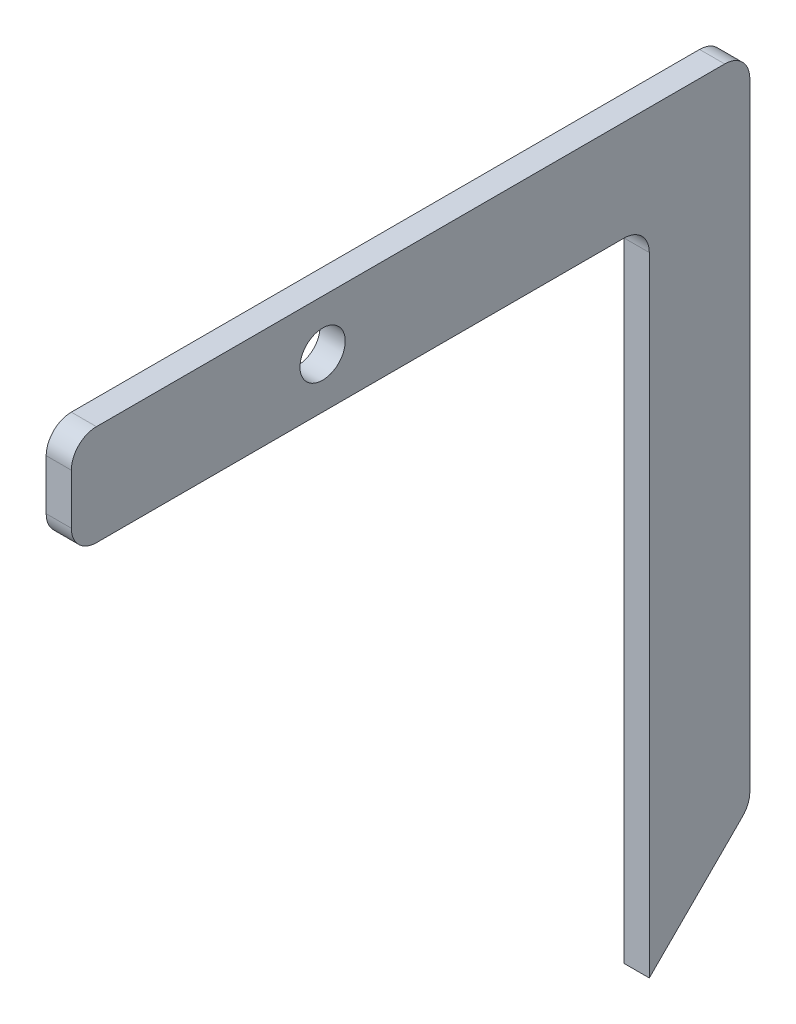
ISO-10303-21;
HEADER;
FILE_DESCRIPTION(('STEP AP214'),'2;1');
FILE_NAME('part.step','',(''),(''),'','','');
FILE_SCHEMA(('AUTOMOTIVE_DESIGN { 1 0 10303 214 1 1 1 1 }'));
ENDSEC;
DATA;
#1=APPLICATION_CONTEXT('core data for automotive mechanical design processes');
#2=APPLICATION_PROTOCOL_DEFINITION('international standard','automotive_design',2000,#1);
#3=PRODUCT_CONTEXT('',#1,'mechanical');
#4=PRODUCT('Part','Part','',(#3));
#5=PRODUCT_RELATED_PRODUCT_CATEGORY('part','',(#4));
#6=PRODUCT_DEFINITION_FORMATION('','',#4);
#7=PRODUCT_DEFINITION_CONTEXT('part definition',#1,'design');
#8=PRODUCT_DEFINITION('design','',#6,#7);
#9=PRODUCT_DEFINITION_SHAPE('','',#8);
#10=(LENGTH_UNIT() NAMED_UNIT(*) SI_UNIT(.MILLI.,.METRE.));
#11=(NAMED_UNIT(*) PLANE_ANGLE_UNIT() SI_UNIT($,.RADIAN.));
#12=(NAMED_UNIT(*) SI_UNIT($,.STERADIAN.) SOLID_ANGLE_UNIT());
#13=UNCERTAINTY_MEASURE_WITH_UNIT(LENGTH_MEASURE(1.E-05),#10,'distance_accuracy_value','');
#14=(GEOMETRIC_REPRESENTATION_CONTEXT(3) GLOBAL_UNCERTAINTY_ASSIGNED_CONTEXT((#13)) GLOBAL_UNIT_ASSIGNED_CONTEXT((#10,
#11,#12)) REPRESENTATION_CONTEXT('',''));
#15=CARTESIAN_POINT('',(0.,0.,0.));
#16=DIRECTION('',(0.,0.,1.));
#17=DIRECTION('',(1.,0.,0.));
#18=AXIS2_PLACEMENT_3D('',#15,#16,#17);
#19=CARTESIAN_POINT('',(-715.,150.,115.));
#20=DIRECTION('',(0.,-1.,0.));
#21=DIRECTION('',(1.,0.,0.));
#22=AXIS2_PLACEMENT_3D('',#19,#20,#21);
#23=PLANE('',#22);
#24=DIRECTION('',(0.,0.,-1.));
#25=VECTOR('',#24,1.);
#26=CARTESIAN_POINT('',(-715.,150.,115.));
#27=LINE('',#26,#25);
#28=CARTESIAN_POINT('',(-715.,150.,110.));
#29=VERTEX_POINT('',#28);
#30=CARTESIAN_POINT('',(-715.,150.,-15.));
#31=VERTEX_POINT('',#30);
#32=EDGE_CURVE('E163',#29,#31,#27,.T.);
#33=ORIENTED_EDGE('',*,*,#32,.F.);
#34=DIRECTION('',(-1.,0.,0.));
#35=VECTOR('',#34,1.);
#36=CARTESIAN_POINT('',(-715.,150.,110.));
#37=LINE('',#36,#35);
#38=CARTESIAN_POINT('',(-710.,150.,110.));
#39=VERTEX_POINT('',#38);
#40=EDGE_CURVE('E183',#29,#39,#37,.F.);
#41=ORIENTED_EDGE('',*,*,#40,.T.);
#42=DIRECTION('',(0.,0.,-1.));
#43=VECTOR('',#42,1.);
#44=CARTESIAN_POINT('',(-710.,150.,115.));
#45=LINE('',#44,#43);
#46=CARTESIAN_POINT('',(-710.,150.,-15.));
#47=VERTEX_POINT('',#46);
#48=EDGE_CURVE('E155',#39,#47,#45,.T.);
#49=ORIENTED_EDGE('',*,*,#48,.T.);
#50=DIRECTION('',(-1.,0.,0.));
#51=VECTOR('',#50,1.);
#52=CARTESIAN_POINT('',(-715.,150.,-15.));
#53=LINE('',#52,#51);
#54=EDGE_CURVE('E180',#47,#31,#53,.T.);
#55=ORIENTED_EDGE('',*,*,#54,.T.);
#56=EDGE_LOOP('',(#33,#41,#49,#55));
#57=FACE_BOUND('',#56,.T.);
#58=ADVANCED_FACE('F34',(#57),#23,.F.);
#59=CARTESIAN_POINT('',(-715.,150.,115.));
#60=DIRECTION('',(1.,0.,0.));
#61=DIRECTION('',(0.,1.,0.));
#62=AXIS2_PLACEMENT_3D('',#59,#60,#61);
#63=PLANE('',#62);
#64=CARTESIAN_POINT('',(-715.,140.,65.));
#65=DIRECTION('',(-1.,0.,0.));
#66=DIRECTION('',(0.,0.,1.));
#67=AXIS2_PLACEMENT_3D('',#64,#65,#66);
#68=CIRCLE('',#67,4.50000000000001);
#69=CARTESIAN_POINT('',(-715.,140.,69.5));
#70=VERTEX_POINT('',#69);
#71=EDGE_CURVE('E140',#70,#70,#68,.T.);
#72=ORIENTED_EDGE('',*,*,#71,.F.);
#73=EDGE_LOOP('',(#72));
#74=FACE_BOUND('',#73,.T.);
#75=DIRECTION('',(0.,-1.,0.));
#76=VECTOR('',#75,1.);
#77=CARTESIAN_POINT('',(-715.,150.,115.));
#78=LINE('',#77,#76);
#79=CARTESIAN_POINT('',(-715.,145.,115.));
#80=VERTEX_POINT('',#79);
#81=CARTESIAN_POINT('',(-715.,135.,115.));
#82=VERTEX_POINT('',#81);
#83=EDGE_CURVE('E149',#80,#82,#78,.T.);
#84=ORIENTED_EDGE('',*,*,#83,.F.);
#85=CARTESIAN_POINT('',(-715.,145.,110.));
#86=DIRECTION('',(1.,0.,0.));
#87=DIRECTION('',(0.,1.,0.));
#88=AXIS2_PLACEMENT_3D('',#85,#86,#87);
#89=CIRCLE('',#88,5.);
#90=EDGE_CURVE('E178',#80,#29,#89,.F.);
#91=ORIENTED_EDGE('',*,*,#90,.T.);
#92=ORIENTED_EDGE('',*,*,#32,.T.);
#93=CARTESIAN_POINT('',(-715.,145.,-15.));
#94=DIRECTION('',(1.,0.,0.));
#95=DIRECTION('',(0.,1.,0.));
#96=AXIS2_PLACEMENT_3D('',#93,#94,#95);
#97=CIRCLE('',#96,5.);
#98=CARTESIAN_POINT('',(-715.,145.,-20.));
#99=VERTEX_POINT('',#98);
#100=EDGE_CURVE('E174',#31,#99,#97,.F.);
#101=ORIENTED_EDGE('',*,*,#100,.T.);
#102=DIRECTION('',(0.,-1.,0.));
#103=VECTOR('',#102,1.);
#104=CARTESIAN_POINT('',(-715.,150.,-20.));
#105=LINE('',#104,#103);
#106=CARTESIAN_POINT('',(-715.,22.0710678118655,-20.));
#107=VERTEX_POINT('',#106);
#108=EDGE_CURVE('E206',#99,#107,#105,.T.);
#109=ORIENTED_EDGE('',*,*,#108,.T.);
#110=CARTESIAN_POINT('',(-714.999999999999,22.0710678118655,-15.));
#111=DIRECTION('',(1.,0.,0.));
#112=DIRECTION('',(0.,1.,0.));
#113=AXIS2_PLACEMENT_3D('',#110,#111,#112);
#114=CIRCLE('',#113,5.);
#115=CARTESIAN_POINT('',(-715.,18.5355339059327,-18.5355339059327));
#116=VERTEX_POINT('',#115);
#117=EDGE_CURVE('E172',#107,#116,#114,.F.);
#118=ORIENTED_EDGE('',*,*,#117,.T.);
#119=DIRECTION('',(0.,-0.707106781186546,0.707106781186549));
#120=VECTOR('',#119,1.);
#121=CARTESIAN_POINT('',(-715.,20.,-20.));
#122=LINE('',#121,#120);
#123=CARTESIAN_POINT('',(-715.,0.,0.));
#124=VERTEX_POINT('',#123);
#125=EDGE_CURVE('E125',#116,#124,#122,.T.);
#126=ORIENTED_EDGE('',*,*,#125,.T.);
#127=DIRECTION('',(0.,-1.,0.));
#128=VECTOR('',#127,1.);
#129=CARTESIAN_POINT('',(-715.,150.,0.));
#130=LINE('',#129,#128);
#131=CARTESIAN_POINT('',(-715.,125.,0.));
#132=VERTEX_POINT('',#131);
#133=EDGE_CURVE('E132',#132,#124,#130,.T.);
#134=ORIENTED_EDGE('',*,*,#133,.F.);
#135=CARTESIAN_POINT('',(-715.,125.,5.));
#136=DIRECTION('',(1.,0.,0.));
#137=DIRECTION('',(0.,1.,0.));
#138=AXIS2_PLACEMENT_3D('',#135,#136,#137);
#139=CIRCLE('',#138,5.);
#140=CARTESIAN_POINT('',(-715.,130.,5.));
#141=VERTEX_POINT('',#140);
#142=EDGE_CURVE('E11',#132,#141,#139,.T.);
#143=ORIENTED_EDGE('',*,*,#142,.T.);
#144=DIRECTION('',(0.,0.,-1.));
#145=VECTOR('',#144,1.);
#146=CARTESIAN_POINT('',(-715.,130.,115.));
#147=LINE('',#146,#145);
#148=CARTESIAN_POINT('',(-715.,130.,110.));
#149=VERTEX_POINT('',#148);
#150=EDGE_CURVE('E160',#149,#141,#147,.T.);
#151=ORIENTED_EDGE('',*,*,#150,.F.);
#152=CARTESIAN_POINT('',(-715.,135.,110.));
#153=DIRECTION('',(1.,0.,0.));
#154=DIRECTION('',(0.,1.,0.));
#155=AXIS2_PLACEMENT_3D('',#152,#153,#154);
#156=CIRCLE('',#155,5.);
#157=EDGE_CURVE('E176',#149,#82,#156,.F.);
#158=ORIENTED_EDGE('',*,*,#157,.T.);
#159=EDGE_LOOP('',(#84,#91,#92,#101,#109,#118,#126,#134,#143,#151,#158));
#160=FACE_BOUND('',#159,.T.);
#161=ADVANCED_FACE('F210',(#74,#160),#63,.F.);
#162=CARTESIAN_POINT('',(-710.,130.,115.));
#163=DIRECTION('',(0.,1.,0.));
#164=DIRECTION('',(-1.,0.,0.));
#165=AXIS2_PLACEMENT_3D('',#162,#163,#164);
#166=PLANE('',#165);
#167=DIRECTION('',(0.,0.,-1.));
#168=VECTOR('',#167,1.);
#169=CARTESIAN_POINT('',(-710.,130.,115.));
#170=LINE('',#169,#168);
#171=CARTESIAN_POINT('',(-710.,130.,110.));
#172=VERTEX_POINT('',#171);
#173=CARTESIAN_POINT('',(-710.,130.,5.));
#174=VERTEX_POINT('',#173);
#175=EDGE_CURVE('E158',#172,#174,#170,.T.);
#176=ORIENTED_EDGE('',*,*,#175,.F.);
#177=DIRECTION('',(1.,0.,0.));
#178=VECTOR('',#177,1.);
#179=CARTESIAN_POINT('',(-710.,130.,110.));
#180=LINE('',#179,#178);
#181=EDGE_CURVE('E195',#172,#149,#180,.F.);
#182=ORIENTED_EDGE('',*,*,#181,.T.);
#183=ORIENTED_EDGE('',*,*,#150,.T.);
#184=DIRECTION('',(1.,0.,0.));
#185=VECTOR('',#184,1.);
#186=CARTESIAN_POINT('',(-710.,130.,5.));
#187=LINE('',#186,#185);
#188=EDGE_CURVE('E192',#141,#174,#187,.T.);
#189=ORIENTED_EDGE('',*,*,#188,.T.);
#190=EDGE_LOOP('',(#176,#182,#183,#189));
#191=FACE_BOUND('',#190,.T.);
#192=ADVANCED_FACE('F236',(#191),#166,.F.);
#193=CARTESIAN_POINT('',(-710.,150.,115.));
#194=DIRECTION('',(-1.,0.,0.));
#195=DIRECTION('',(0.,-1.,0.));
#196=AXIS2_PLACEMENT_3D('',#193,#194,#195);
#197=PLANE('',#196);
#198=CARTESIAN_POINT('',(-710.,140.,65.));
#199=DIRECTION('',(-1.,0.,0.));
#200=DIRECTION('',(0.,-1.,0.));
#201=AXIS2_PLACEMENT_3D('',#198,#199,#200);
#202=CIRCLE('',#201,4.50000000000001);
#203=CARTESIAN_POINT('',(-710.,135.5,65.));
#204=VERTEX_POINT('',#203);
#205=EDGE_CURVE('E143',#204,#204,#202,.F.);
#206=ORIENTED_EDGE('',*,*,#205,.F.);
#207=EDGE_LOOP('',(#206));
#208=FACE_BOUND('',#207,.T.);
#209=ORIENTED_EDGE('',*,*,#48,.F.);
#210=CARTESIAN_POINT('',(-710.,145.,110.));
#211=DIRECTION('',(-1.,0.,0.));
#212=DIRECTION('',(0.,-1.,0.));
#213=AXIS2_PLACEMENT_3D('',#210,#211,#212);
#214=CIRCLE('',#213,5.);
#215=CARTESIAN_POINT('',(-710.,145.,115.));
#216=VERTEX_POINT('',#215);
#217=EDGE_CURVE('E190',#39,#216,#214,.F.);
#218=ORIENTED_EDGE('',*,*,#217,.T.);
#219=DIRECTION('',(0.,1.,0.));
#220=VECTOR('',#219,1.);
#221=CARTESIAN_POINT('',(-710.,150.,115.));
#222=LINE('',#221,#220);
#223=CARTESIAN_POINT('',(-710.,135.,115.));
#224=VERTEX_POINT('',#223);
#225=EDGE_CURVE('E152',#224,#216,#222,.T.);
#226=ORIENTED_EDGE('',*,*,#225,.F.);
#227=CARTESIAN_POINT('',(-710.,135.,110.));
#228=DIRECTION('',(-1.,0.,0.));
#229=DIRECTION('',(0.,-1.,0.));
#230=AXIS2_PLACEMENT_3D('',#227,#228,#229);
#231=CIRCLE('',#230,5.);
#232=EDGE_CURVE('E188',#224,#172,#231,.F.);
#233=ORIENTED_EDGE('',*,*,#232,.T.);
#234=ORIENTED_EDGE('',*,*,#175,.T.);
#235=CARTESIAN_POINT('',(-710.,125.,5.));
#236=DIRECTION('',(-1.,0.,0.));
#237=DIRECTION('',(0.,-1.,0.));
#238=AXIS2_PLACEMENT_3D('',#235,#236,#237);
#239=CIRCLE('',#238,5.);
#240=CARTESIAN_POINT('',(-710.,125.,0.));
#241=VERTEX_POINT('',#240);
#242=EDGE_CURVE('E42',#174,#241,#239,.T.);
#243=ORIENTED_EDGE('',*,*,#242,.T.);
#244=DIRECTION('',(0.,-1.,0.));
#245=VECTOR('',#244,1.);
#246=CARTESIAN_POINT('',(-710.,150.,0.));
#247=LINE('',#246,#245);
#248=CARTESIAN_POINT('',(-710.,0.,0.));
#249=VERTEX_POINT('',#248);
#250=EDGE_CURVE('E116',#241,#249,#247,.T.);
#251=ORIENTED_EDGE('',*,*,#250,.T.);
#252=DIRECTION('',(0.,0.707106781186546,-0.707106781186549));
#253=VECTOR('',#252,1.);
#254=CARTESIAN_POINT('',(-710.,20.,-20.));
#255=LINE('',#254,#253);
#256=CARTESIAN_POINT('',(-710.,18.5355339059327,-18.5355339059327));
#257=VERTEX_POINT('',#256);
#258=EDGE_CURVE('E121',#249,#257,#255,.T.);
#259=ORIENTED_EDGE('',*,*,#258,.T.);
#260=CARTESIAN_POINT('',(-709.999999999999,22.0710678118655,-15.));
#261=DIRECTION('',(-1.,0.,0.));
#262=DIRECTION('',(0.,-1.,0.));
#263=AXIS2_PLACEMENT_3D('',#260,#261,#262);
#264=CIRCLE('',#263,5.);
#265=CARTESIAN_POINT('',(-710.,22.0710678118655,-20.));
#266=VERTEX_POINT('',#265);
#267=EDGE_CURVE('E49',#257,#266,#264,.F.);
#268=ORIENTED_EDGE('',*,*,#267,.T.);
#269=DIRECTION('',(0.,-1.,0.));
#270=VECTOR('',#269,1.);
#271=CARTESIAN_POINT('',(-710.,150.,-20.));
#272=LINE('',#271,#270);
#273=CARTESIAN_POINT('',(-710.,145.,-20.));
#274=VERTEX_POINT('',#273);
#275=EDGE_CURVE('E126',#274,#266,#272,.T.);
#276=ORIENTED_EDGE('',*,*,#275,.F.);
#277=CARTESIAN_POINT('',(-710.,145.,-15.));
#278=DIRECTION('',(-1.,0.,0.));
#279=DIRECTION('',(0.,-1.,0.));
#280=AXIS2_PLACEMENT_3D('',#277,#278,#279);
#281=CIRCLE('',#280,5.);
#282=EDGE_CURVE('E186',#274,#47,#281,.F.);
#283=ORIENTED_EDGE('',*,*,#282,.T.);
#284=EDGE_LOOP('',(#209,#218,#226,#233,#234,#243,#251,#259,#268,#276,#283));
#285=FACE_BOUND('',#284,.T.);
#286=ADVANCED_FACE('F119',(#208,#285),#197,.F.);
#287=CARTESIAN_POINT('',(2.50000000000006,-9.99999999999995,115.));
#288=DIRECTION('',(0.,0.,-1.));
#289=DIRECTION('',(0.,1.,0.));
#290=AXIS2_PLACEMENT_3D('',#287,#288,#289);
#291=PLANE('',#290);
#292=ORIENTED_EDGE('',*,*,#225,.T.);
#293=DIRECTION('',(-1.,0.,0.));
#294=VECTOR('',#293,1.);
#295=CARTESIAN_POINT('',(2.4999999999992,145.000000000004,115.));
#296=LINE('',#295,#294);
#297=EDGE_CURVE('E169',#216,#80,#296,.T.);
#298=ORIENTED_EDGE('',*,*,#297,.T.);
#299=ORIENTED_EDGE('',*,*,#83,.T.);
#300=DIRECTION('',(1.,0.,0.));
#301=VECTOR('',#300,1.);
#302=CARTESIAN_POINT('',(2.49999999999925,135.000000000004,115.));
#303=LINE('',#302,#301);
#304=EDGE_CURVE('E166',#82,#224,#303,.T.);
#305=ORIENTED_EDGE('',*,*,#304,.T.);
#306=EDGE_LOOP('',(#292,#298,#299,#305));
#307=FACE_BOUND('',#306,.T.);
#308=ADVANCED_FACE('F227',(#307),#291,.F.);
#309=CARTESIAN_POINT('',(727.501,140.,65.));
#310=DIRECTION('',(-1.,0.,0.));
#311=DIRECTION('',(0.,0.,1.));
#312=AXIS2_PLACEMENT_3D('',#309,#310,#311);
#313=CYLINDRICAL_SURFACE('',#312,4.50000000000001);
#314=ORIENTED_EDGE('',*,*,#71,.T.);
#315=EDGE_LOOP('',(#314));
#316=FACE_BOUND('',#315,.T.);
#317=ORIENTED_EDGE('',*,*,#205,.T.);
#318=EDGE_LOOP('',(#317));
#319=FACE_BOUND('',#318,.T.);
#320=ADVANCED_FACE('F316',(#316,#319),#313,.F.);
#321=CARTESIAN_POINT('',(-710.,150.,0.));
#322=DIRECTION('',(0.,0.,-1.));
#323=DIRECTION('',(-1.,0.,0.));
#324=AXIS2_PLACEMENT_3D('',#321,#322,#323);
#325=PLANE('',#324);
#326=ORIENTED_EDGE('',*,*,#250,.F.);
#327=DIRECTION('',(1.,0.,0.));
#328=VECTOR('',#327,1.);
#329=CARTESIAN_POINT('',(-715.,125.,0.));
#330=LINE('',#329,#328);
#331=EDGE_CURVE('E197',#241,#132,#330,.F.);
#332=ORIENTED_EDGE('',*,*,#331,.T.);
#333=ORIENTED_EDGE('',*,*,#133,.T.);
#334=DIRECTION('',(1.,0.,0.));
#335=VECTOR('',#334,1.);
#336=CARTESIAN_POINT('',(-710.,0.,0.));
#337=LINE('',#336,#335);
#338=EDGE_CURVE('E129',#124,#249,#337,.T.);
#339=ORIENTED_EDGE('',*,*,#338,.T.);
#340=EDGE_LOOP('',(#326,#332,#333,#339));
#341=FACE_BOUND('',#340,.T.);
#342=ADVANCED_FACE('F130',(#341),#325,.F.);
#343=CARTESIAN_POINT('',(-715.,150.,-20.));
#344=DIRECTION('',(0.,0.,1.));
#345=DIRECTION('',(1.,0.,0.));
#346=AXIS2_PLACEMENT_3D('',#343,#344,#345);
#347=PLANE('',#346);
#348=ORIENTED_EDGE('',*,*,#108,.F.);
#349=DIRECTION('',(-1.,0.,0.));
#350=VECTOR('',#349,1.);
#351=CARTESIAN_POINT('',(-715.,145.,-20.));
#352=LINE('',#351,#350);
#353=EDGE_CURVE('E56',#99,#274,#352,.F.);
#354=ORIENTED_EDGE('',*,*,#353,.T.);
#355=ORIENTED_EDGE('',*,*,#275,.T.);
#356=DIRECTION('',(-1.,0.,0.));
#357=VECTOR('',#356,1.);
#358=CARTESIAN_POINT('',(-715.,22.0710678118655,-20.));
#359=LINE('',#358,#357);
#360=EDGE_CURVE('E199',#266,#107,#359,.T.);
#361=ORIENTED_EDGE('',*,*,#360,.T.);
#362=EDGE_LOOP('',(#348,#354,#355,#361));
#363=FACE_BOUND('',#362,.T.);
#364=ADVANCED_FACE('F205',(#363),#347,.F.);
#365=CARTESIAN_POINT('',(-715.,20.,-20.));
#366=DIRECTION('',(0.,-0.707106781186549,-0.707106781186546));
#367=DIRECTION('',(1.,0.,0.));
#368=AXIS2_PLACEMENT_3D('',#365,#366,#367);
#369=PLANE('',#368);
#370=ORIENTED_EDGE('',*,*,#125,.F.);
#371=DIRECTION('',(-1.,0.,0.));
#372=VECTOR('',#371,1.);
#373=CARTESIAN_POINT('',(-710.,18.5355339059327,-18.5355339059327));
#374=LINE('',#373,#372);
#375=EDGE_CURVE('E139',#116,#257,#374,.F.);
#376=ORIENTED_EDGE('',*,*,#375,.T.);
#377=ORIENTED_EDGE('',*,*,#258,.F.);
#378=ORIENTED_EDGE('',*,*,#338,.F.);
#379=EDGE_LOOP('',(#370,#376,#377,#378));
#380=FACE_BOUND('',#379,.T.);
#381=ADVANCED_FACE('F137',(#380),#369,.T.);
#382=CARTESIAN_POINT('',(2.4999999999992,145.000000000004,110.));
#383=DIRECTION('',(-1.,0.,0.));
#384=DIRECTION('',(0.,-1.,0.));
#385=AXIS2_PLACEMENT_3D('',#382,#383,#384);
#386=CYLINDRICAL_SURFACE('',#385,5.);
#387=ORIENTED_EDGE('',*,*,#217,.F.);
#388=ORIENTED_EDGE('',*,*,#40,.F.);
#389=ORIENTED_EDGE('',*,*,#90,.F.);
#390=ORIENTED_EDGE('',*,*,#297,.F.);
#391=EDGE_LOOP('',(#387,#388,#389,#390));
#392=FACE_BOUND('',#391,.T.);
#393=ADVANCED_FACE('F225',(#392),#386,.T.);
#394=CARTESIAN_POINT('',(2.49999999999925,135.000000000004,110.));
#395=DIRECTION('',(1.,0.,0.));
#396=DIRECTION('',(0.,1.,0.));
#397=AXIS2_PLACEMENT_3D('',#394,#395,#396);
#398=CYLINDRICAL_SURFACE('',#397,5.);
#399=ORIENTED_EDGE('',*,*,#157,.F.);
#400=ORIENTED_EDGE('',*,*,#181,.F.);
#401=ORIENTED_EDGE('',*,*,#232,.F.);
#402=ORIENTED_EDGE('',*,*,#304,.F.);
#403=EDGE_LOOP('',(#399,#400,#401,#402));
#404=FACE_BOUND('',#403,.T.);
#405=ADVANCED_FACE('F233',(#404),#398,.T.);
#406=CARTESIAN_POINT('',(-710.,125.,5.));
#407=DIRECTION('',(-1.,0.,0.));
#408=DIRECTION('',(0.,-1.,0.));
#409=AXIS2_PLACEMENT_3D('',#406,#407,#408);
#410=CYLINDRICAL_SURFACE('',#409,5.);
#411=ORIENTED_EDGE('',*,*,#142,.F.);
#412=ORIENTED_EDGE('',*,*,#331,.F.);
#413=ORIENTED_EDGE('',*,*,#242,.F.);
#414=ORIENTED_EDGE('',*,*,#188,.F.);
#415=EDGE_LOOP('',(#411,#412,#413,#414));
#416=FACE_BOUND('',#415,.T.);
#417=ADVANCED_FACE('F240',(#416),#410,.F.);
#418=CARTESIAN_POINT('',(-715.,145.,-15.));
#419=DIRECTION('',(-1.,0.,0.));
#420=DIRECTION('',(0.,-1.,0.));
#421=AXIS2_PLACEMENT_3D('',#418,#419,#420);
#422=CYLINDRICAL_SURFACE('',#421,5.);
#423=ORIENTED_EDGE('',*,*,#282,.F.);
#424=ORIENTED_EDGE('',*,*,#353,.F.);
#425=ORIENTED_EDGE('',*,*,#100,.F.);
#426=ORIENTED_EDGE('',*,*,#54,.F.);
#427=EDGE_LOOP('',(#423,#424,#425,#426));
#428=FACE_BOUND('',#427,.T.);
#429=ADVANCED_FACE('F218',(#428),#422,.T.);
#430=CARTESIAN_POINT('',(-715.,22.0710678118655,-15.));
#431=DIRECTION('',(1.,0.,0.));
#432=DIRECTION('',(0.,0.,-1.));
#433=AXIS2_PLACEMENT_3D('',#430,#431,#432);
#434=CYLINDRICAL_SURFACE('',#433,5.);
#435=ORIENTED_EDGE('',*,*,#267,.F.);
#436=ORIENTED_EDGE('',*,*,#375,.F.);
#437=ORIENTED_EDGE('',*,*,#117,.F.);
#438=ORIENTED_EDGE('',*,*,#360,.F.);
#439=EDGE_LOOP('',(#435,#436,#437,#438));
#440=FACE_BOUND('',#439,.T.);
#441=ADVANCED_FACE('F36',(#440),#434,.T.);
#442=CLOSED_SHELL('',(#58,#161,#192,#286,#308,#320,#342,#364,#381,#393,#405,#417,#429,#441));
#443=MANIFOLD_SOLID_BREP('B2',#442);
#444=ADVANCED_BREP_SHAPE_REPRESENTATION('',(#18,#443),#14);
#445=SHAPE_DEFINITION_REPRESENTATION(#9,#444);
ENDSEC;
END-ISO-10303-21;
